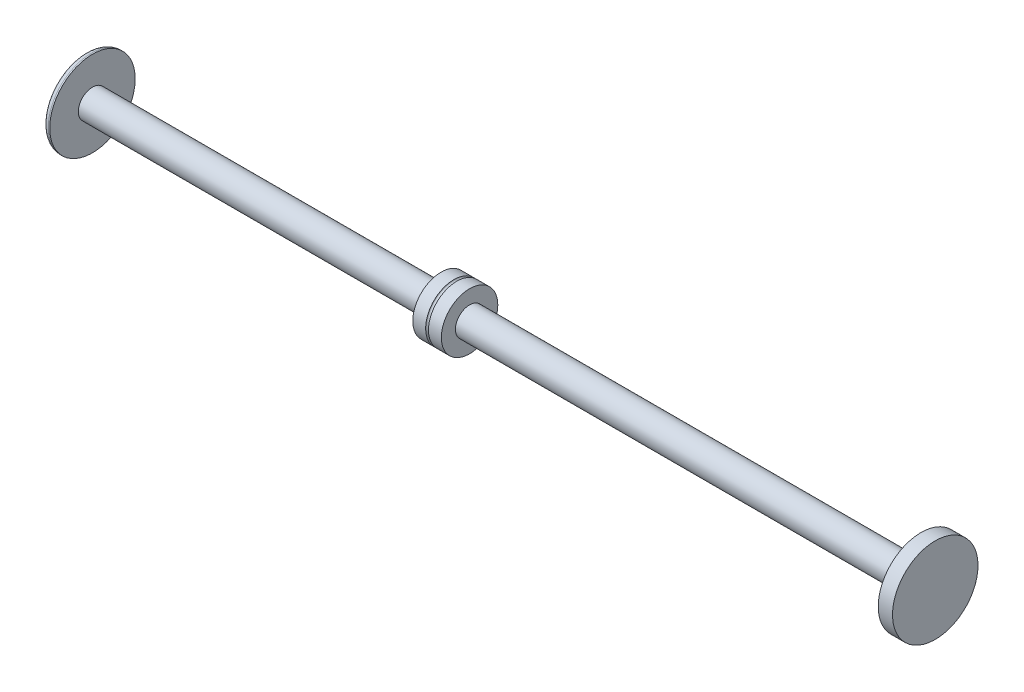
ISO-10303-21;
HEADER;
FILE_DESCRIPTION(('STEP AP214'),'2;1');
FILE_NAME('part.step','',(''),(''),'','','');
FILE_SCHEMA(('AUTOMOTIVE_DESIGN { 1 0 10303 214 1 1 1 1 }'));
ENDSEC;
DATA;
#1=APPLICATION_CONTEXT('core data for automotive mechanical design processes');
#2=APPLICATION_PROTOCOL_DEFINITION('international standard','automotive_design',2000,#1);
#3=PRODUCT_CONTEXT('',#1,'mechanical');
#4=PRODUCT('Part','Part','',(#3));
#5=PRODUCT_RELATED_PRODUCT_CATEGORY('part','',(#4));
#6=PRODUCT_DEFINITION_FORMATION('','',#4);
#7=PRODUCT_DEFINITION_CONTEXT('part definition',#1,'design');
#8=PRODUCT_DEFINITION('design','',#6,#7);
#9=PRODUCT_DEFINITION_SHAPE('','',#8);
#10=(LENGTH_UNIT() NAMED_UNIT(*) SI_UNIT(.MILLI.,.METRE.));
#11=(NAMED_UNIT(*) PLANE_ANGLE_UNIT() SI_UNIT($,.RADIAN.));
#12=(NAMED_UNIT(*) SI_UNIT($,.STERADIAN.) SOLID_ANGLE_UNIT());
#13=UNCERTAINTY_MEASURE_WITH_UNIT(LENGTH_MEASURE(1.E-05),#10,'distance_accuracy_value','');
#14=(GEOMETRIC_REPRESENTATION_CONTEXT(3) GLOBAL_UNCERTAINTY_ASSIGNED_CONTEXT((#13)) GLOBAL_UNIT_ASSIGNED_CONTEXT((#10,
#11,#12)) REPRESENTATION_CONTEXT('',''));
#15=CARTESIAN_POINT('',(0.,0.,0.));
#16=DIRECTION('',(0.,0.,1.));
#17=DIRECTION('',(1.,0.,0.));
#18=AXIS2_PLACEMENT_3D('',#15,#16,#17);
#19=CARTESIAN_POINT('',(25.3999999999987,1432.78731013692,-190.19980395356));
#20=DIRECTION('',(1.,0.,0.));
#21=DIRECTION('',(0.,0.,-1.));
#22=AXIS2_PLACEMENT_3D('',#19,#20,#21);
#23=CYLINDRICAL_SURFACE('',#22,12.5476);
#24=CARTESIAN_POINT('',(2.53999999999853,1432.78731013692,-190.19980395356));
#25=DIRECTION('',(1.,0.,0.));
#26=DIRECTION('',(0.,0.,-1.));
#27=AXIS2_PLACEMENT_3D('',#24,#25,#26);
#28=CIRCLE('',#27,12.5476);
#29=CARTESIAN_POINT('',(2.53999999999853,1432.78731013692,-202.74740395356));
#30=VERTEX_POINT('',#29);
#31=EDGE_CURVE('E71',#30,#30,#28,.T.);
#32=ORIENTED_EDGE('',*,*,#31,.T.);
#33=EDGE_LOOP('',(#32));
#34=FACE_BOUND('',#33,.T.);
#35=CARTESIAN_POINT('',(8.25499999999857,1432.78731013692,-190.19980395356));
#36=DIRECTION('',(1.,0.,0.));
#37=DIRECTION('',(0.,0.,-1.));
#38=AXIS2_PLACEMENT_3D('',#35,#36,#37);
#39=CIRCLE('',#38,12.5476);
#40=CARTESIAN_POINT('',(8.25499999999857,1432.78731013692,-202.74740395356));
#41=VERTEX_POINT('',#40);
#42=EDGE_CURVE('E50',#41,#41,#39,.F.);
#43=ORIENTED_EDGE('',*,*,#42,.T.);
#44=EDGE_LOOP('',(#43));
#45=FACE_BOUND('',#44,.T.);
#46=ADVANCED_FACE('F46',(#34,#45),#23,.T.);
#47=CARTESIAN_POINT('',(25.3999999999987,1432.78731013692,-190.19980395356));
#48=DIRECTION('',(1.,0.,0.));
#49=DIRECTION('',(0.,0.,-1.));
#50=AXIS2_PLACEMENT_3D('',#47,#48,#49);
#51=CYLINDRICAL_SURFACE('',#50,6.29920000000017);
#52=CARTESIAN_POINT('',(-152.400000000002,1432.78731013692,-190.19980395356));
#53=DIRECTION('',(1.,0.,0.));
#54=DIRECTION('',(0.,0.,-1.));
#55=AXIS2_PLACEMENT_3D('',#52,#53,#54);
#56=CIRCLE('',#55,6.29920000000017);
#57=CARTESIAN_POINT('',(-152.400000000002,1432.78731013692,-196.49900395356));
#58=VERTEX_POINT('',#57);
#59=EDGE_CURVE('E12',#58,#58,#56,.T.);
#60=ORIENTED_EDGE('',*,*,#59,.T.);
#61=EDGE_LOOP('',(#60));
#62=FACE_BOUND('',#61,.T.);
#63=CARTESIAN_POINT('',(2.53999999999849,1432.78731013692,-190.19980395356));
#64=DIRECTION('',(1.,0.,0.));
#65=DIRECTION('',(0.,0.,-1.));
#66=AXIS2_PLACEMENT_3D('',#63,#64,#65);
#67=CIRCLE('',#66,6.29920000000017);
#68=CARTESIAN_POINT('',(2.53999999999849,1432.78731013692,-196.49900395356));
#69=VERTEX_POINT('',#68);
#70=EDGE_CURVE('E67',#69,#69,#67,.T.);
#71=ORIENTED_EDGE('',*,*,#70,.F.);
#72=EDGE_LOOP('',(#71));
#73=FACE_BOUND('',#72,.T.);
#74=ADVANCED_FACE('F48',(#62,#73),#51,.T.);
#75=CARTESIAN_POINT('',(-152.400000000002,1439.08651013692,-190.19980395356));
#76=DIRECTION('',(1.,0.,0.));
#77=DIRECTION('',(0.,0.,-1.));
#78=AXIS2_PLACEMENT_3D('',#75,#76,#77);
#79=PLANE('',#78);
#80=CARTESIAN_POINT('',(-152.400000000002,1432.78731013692,-190.19980395356));
#81=DIRECTION('',(1.,0.,0.));
#82=DIRECTION('',(0.,0.,-1.));
#83=AXIS2_PLACEMENT_3D('',#80,#81,#82);
#84=CIRCLE('',#83,18.9992000000001);
#85=CARTESIAN_POINT('',(-152.400000000002,1432.78731013692,-209.19900395356));
#86=VERTEX_POINT('',#85);
#87=EDGE_CURVE('E54',#86,#86,#84,.T.);
#88=ORIENTED_EDGE('',*,*,#87,.T.);
#89=EDGE_LOOP('',(#88));
#90=FACE_BOUND('',#89,.T.);
#91=ORIENTED_EDGE('',*,*,#59,.F.);
#92=EDGE_LOOP('',(#91));
#93=FACE_BOUND('',#92,.T.);
#94=ADVANCED_FACE('F113',(#90,#93),#79,.T.);
#95=CARTESIAN_POINT('',(25.3999999999987,1432.78731013692,-190.19980395356));
#96=DIRECTION('',(1.,0.,0.));
#97=DIRECTION('',(0.,0.,-1.));
#98=AXIS2_PLACEMENT_3D('',#95,#96,#97);
#99=CYLINDRICAL_SURFACE('',#98,18.9992000000001);
#100=CARTESIAN_POINT('',(-153.035000000002,1432.78731013692,-190.19980395356));
#101=DIRECTION('',(1.,0.,0.));
#102=DIRECTION('',(0.,0.,-1.));
#103=AXIS2_PLACEMENT_3D('',#100,#101,#102);
#104=CIRCLE('',#103,18.9992000000001);
#105=CARTESIAN_POINT('',(-153.035000000002,1432.78731013692,-209.19900395356));
#106=VERTEX_POINT('',#105);
#107=EDGE_CURVE('E59',#106,#106,#104,.T.);
#108=ORIENTED_EDGE('',*,*,#107,.T.);
#109=EDGE_LOOP('',(#108));
#110=FACE_BOUND('',#109,.T.);
#111=ORIENTED_EDGE('',*,*,#87,.F.);
#112=EDGE_LOOP('',(#111));
#113=FACE_BOUND('',#112,.T.);
#114=ADVANCED_FACE('F98',(#110,#113),#99,.T.);
#115=CARTESIAN_POINT('',(-153.035000000002,1432.78731013692,-190.19980395356));
#116=DIRECTION('',(1.,0.,0.));
#117=DIRECTION('',(0.,0.,-1.));
#118=AXIS2_PLACEMENT_3D('',#115,#116,#117);
#119=TOROIDAL_SURFACE('',#118,16.4592000000001,2.53999999999999);
#120=CARTESIAN_POINT('',(-155.575000000002,1432.78731013692,-190.19980395356));
#121=DIRECTION('',(1.,0.,0.));
#122=DIRECTION('',(0.,0.,-1.));
#123=AXIS2_PLACEMENT_3D('',#120,#121,#122);
#124=CIRCLE('',#123,16.4592000000001);
#125=CARTESIAN_POINT('',(-155.575000000002,1432.78731013692,-206.65900395356));
#126=VERTEX_POINT('',#125);
#127=EDGE_CURVE('E93',#126,#126,#124,.T.);
#128=ORIENTED_EDGE('',*,*,#127,.T.);
#129=EDGE_LOOP('',(#128));
#130=FACE_BOUND('',#129,.T.);
#131=ORIENTED_EDGE('',*,*,#107,.F.);
#132=EDGE_LOOP('',(#131));
#133=FACE_BOUND('',#132,.T.);
#134=ADVANCED_FACE('F101',(#130,#133),#119,.T.);
#135=CARTESIAN_POINT('',(-155.575000000002,1449.24651013692,-190.19980395356));
#136=DIRECTION('',(-1.,0.,0.));
#137=DIRECTION('',(0.,0.,1.));
#138=AXIS2_PLACEMENT_3D('',#135,#136,#137);
#139=PLANE('',#138);
#140=ORIENTED_EDGE('',*,*,#127,.F.);
#141=EDGE_LOOP('',(#140));
#142=FACE_BOUND('',#141,.T.);
#143=ADVANCED_FACE('F103',(#142),#139,.T.);
#144=CARTESIAN_POINT('',(2.53999999999851,1445.33491013692,-190.19980395356));
#145=DIRECTION('',(-1.,0.,0.));
#146=DIRECTION('',(0.,0.,1.));
#147=AXIS2_PLACEMENT_3D('',#144,#145,#146);
#148=PLANE('',#147);
#149=ORIENTED_EDGE('',*,*,#70,.T.);
#150=EDGE_LOOP('',(#149));
#151=FACE_BOUND('',#150,.T.);
#152=ORIENTED_EDGE('',*,*,#31,.F.);
#153=EDGE_LOOP('',(#152));
#154=FACE_BOUND('',#153,.T.);
#155=ADVANCED_FACE('F110',(#151,#154),#148,.T.);
#156=CARTESIAN_POINT('',(8.88999999999853,1432.78731013692,-190.19980395356));
#157=DIRECTION('',(-1.,0.,0.));
#158=DIRECTION('',(0.,0.,1.));
#159=AXIS2_PLACEMENT_3D('',#156,#157,#158);
#160=TOROIDAL_SURFACE('',#159,12.5476,0.634999999999963);
#161=ORIENTED_EDGE('',*,*,#42,.F.);
#162=EDGE_LOOP('',(#161));
#163=FACE_BOUND('',#162,.T.);
#164=CARTESIAN_POINT('',(9.52499999999849,1432.78731013692,-190.19980395356));
#165=DIRECTION('',(-1.,0.,0.));
#166=DIRECTION('',(0.,0.,1.));
#167=AXIS2_PLACEMENT_3D('',#164,#165,#166);
#168=CIRCLE('',#167,12.5476);
#169=CARTESIAN_POINT('',(9.52499999999849,1432.78731013692,-177.65220395356));
#170=VERTEX_POINT('',#169);
#171=EDGE_CURVE('E62',#170,#170,#168,.F.);
#172=ORIENTED_EDGE('',*,*,#171,.F.);
#173=EDGE_LOOP('',(#172));
#174=FACE_BOUND('',#173,.T.);
#175=ADVANCED_FACE('F155',(#163,#174),#160,.F.);
#176=CARTESIAN_POINT('',(222.249999999999,1432.78731013692,-190.19980395356));
#177=DIRECTION('',(1.,0.,0.));
#178=DIRECTION('',(0.,0.,-1.));
#179=AXIS2_PLACEMENT_3D('',#176,#177,#178);
#180=PLANE('',#179);
#181=CARTESIAN_POINT('',(222.249999999999,1432.78731013692,-190.19980395356));
#182=DIRECTION('',(1.,0.,0.));
#183=DIRECTION('',(0.,0.,-1.));
#184=AXIS2_PLACEMENT_3D('',#181,#182,#183);
#185=CIRCLE('',#184,18.9992000000001);
#186=CARTESIAN_POINT('',(222.249999999999,1432.78731013692,-209.19900395356));
#187=VERTEX_POINT('',#186);
#188=EDGE_CURVE('E90',#187,#187,#185,.T.);
#189=ORIENTED_EDGE('',*,*,#188,.T.);
#190=EDGE_LOOP('',(#189));
#191=FACE_BOUND('',#190,.T.);
#192=ADVANCED_FACE('F150',(#191),#180,.T.);
#193=CARTESIAN_POINT('',(25.3999999999987,1432.78731013692,-190.19980395356));
#194=DIRECTION('',(1.,0.,0.));
#195=DIRECTION('',(0.,0.,-1.));
#196=AXIS2_PLACEMENT_3D('',#193,#194,#195);
#197=CYLINDRICAL_SURFACE('',#196,18.9992000000001);
#198=CARTESIAN_POINT('',(215.899999999999,1432.78731013692,-190.19980395356));
#199=DIRECTION('',(1.,0.,0.));
#200=DIRECTION('',(0.,0.,-1.));
#201=AXIS2_PLACEMENT_3D('',#198,#199,#200);
#202=CIRCLE('',#201,18.9992000000001);
#203=CARTESIAN_POINT('',(215.899999999999,1432.78731013692,-209.19900395356));
#204=VERTEX_POINT('',#203);
#205=EDGE_CURVE('E87',#204,#204,#202,.T.);
#206=ORIENTED_EDGE('',*,*,#205,.T.);
#207=EDGE_LOOP('',(#206));
#208=FACE_BOUND('',#207,.T.);
#209=ORIENTED_EDGE('',*,*,#188,.F.);
#210=EDGE_LOOP('',(#209));
#211=FACE_BOUND('',#210,.T.);
#212=ADVANCED_FACE('F144',(#208,#211),#197,.T.);
#213=CARTESIAN_POINT('',(215.899999999999,1451.78651013692,-190.19980395356));
#214=DIRECTION('',(-1.,0.,0.));
#215=DIRECTION('',(0.,0.,1.));
#216=AXIS2_PLACEMENT_3D('',#213,#214,#215);
#217=PLANE('',#216);
#218=CARTESIAN_POINT('',(215.899999999999,1432.78731013692,-190.19980395356));
#219=DIRECTION('',(1.,0.,0.));
#220=DIRECTION('',(0.,0.,-1.));
#221=AXIS2_PLACEMENT_3D('',#218,#219,#220);
#222=CIRCLE('',#221,6.29920000000017);
#223=CARTESIAN_POINT('',(215.899999999999,1432.78731013692,-196.49900395356));
#224=VERTEX_POINT('',#223);
#225=EDGE_CURVE('E84',#224,#224,#222,.T.);
#226=ORIENTED_EDGE('',*,*,#225,.T.);
#227=EDGE_LOOP('',(#226));
#228=FACE_BOUND('',#227,.T.);
#229=ORIENTED_EDGE('',*,*,#205,.F.);
#230=EDGE_LOOP('',(#229));
#231=FACE_BOUND('',#230,.T.);
#232=ADVANCED_FACE('F138',(#228,#231),#217,.T.);
#233=CARTESIAN_POINT('',(25.3999999999987,1432.78731013692,-190.19980395356));
#234=DIRECTION('',(1.,0.,0.));
#235=DIRECTION('',(0.,0.,-1.));
#236=AXIS2_PLACEMENT_3D('',#233,#234,#235);
#237=CYLINDRICAL_SURFACE('',#236,6.29920000000017);
#238=CARTESIAN_POINT('',(15.2399999999985,1432.78731013692,-190.19980395356));
#239=DIRECTION('',(1.,0.,0.));
#240=DIRECTION('',(0.,0.,-1.));
#241=AXIS2_PLACEMENT_3D('',#238,#239,#240);
#242=CIRCLE('',#241,6.29920000000017);
#243=CARTESIAN_POINT('',(15.2399999999985,1432.78731013692,-196.49900395356));
#244=VERTEX_POINT('',#243);
#245=EDGE_CURVE('E81',#244,#244,#242,.T.);
#246=ORIENTED_EDGE('',*,*,#245,.T.);
#247=EDGE_LOOP('',(#246));
#248=FACE_BOUND('',#247,.T.);
#249=ORIENTED_EDGE('',*,*,#225,.F.);
#250=EDGE_LOOP('',(#249));
#251=FACE_BOUND('',#250,.T.);
#252=ADVANCED_FACE('F130',(#248,#251),#237,.T.);
#253=CARTESIAN_POINT('',(15.2399999999985,1445.33491013692,-190.19980395356));
#254=DIRECTION('',(1.,0.,0.));
#255=DIRECTION('',(0.,0.,-1.));
#256=AXIS2_PLACEMENT_3D('',#253,#254,#255);
#257=PLANE('',#256);
#258=CARTESIAN_POINT('',(15.2399999999985,1432.78731013692,-190.19980395356));
#259=DIRECTION('',(1.,0.,0.));
#260=DIRECTION('',(0.,0.,-1.));
#261=AXIS2_PLACEMENT_3D('',#258,#259,#260);
#262=CIRCLE('',#261,12.5476);
#263=CARTESIAN_POINT('',(15.2399999999985,1432.78731013692,-202.74740395356));
#264=VERTEX_POINT('',#263);
#265=EDGE_CURVE('E76',#264,#264,#262,.T.);
#266=ORIENTED_EDGE('',*,*,#265,.T.);
#267=EDGE_LOOP('',(#266));
#268=FACE_BOUND('',#267,.T.);
#269=ORIENTED_EDGE('',*,*,#245,.F.);
#270=EDGE_LOOP('',(#269));
#271=FACE_BOUND('',#270,.T.);
#272=ADVANCED_FACE('F125',(#268,#271),#257,.T.);
#273=ORIENTED_EDGE('',*,*,#265,.F.);
#274=EDGE_LOOP('',(#273));
#275=FACE_BOUND('',#274,.T.);
#276=ORIENTED_EDGE('',*,*,#171,.T.);
#277=EDGE_LOOP('',(#276));
#278=FACE_BOUND('',#277,.T.);
#279=ADVANCED_FACE('F118',(#275,#278),#23,.T.);
#280=CLOSED_SHELL('',(#46,#74,#94,#114,#134,#143,#155,#175,#192,#212,#232,#252,#272,#279));
#281=MANIFOLD_SOLID_BREP('B2',#280);
#282=ADVANCED_BREP_SHAPE_REPRESENTATION('',(#18,#281),#14);
#283=SHAPE_DEFINITION_REPRESENTATION(#9,#282);
ENDSEC;
END-ISO-10303-21;
